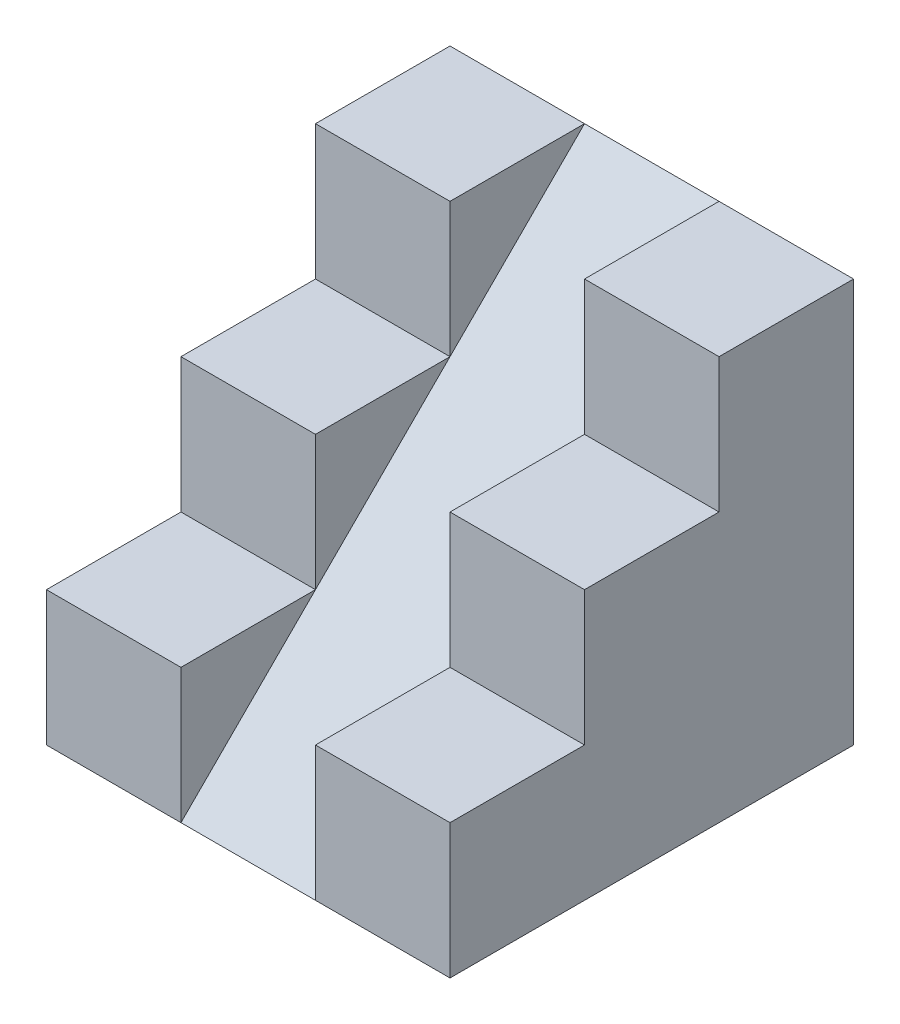
ISO-10303-21;
HEADER;
FILE_DESCRIPTION(('STEP AP214'),'2;1');
FILE_NAME('part.step','',(''),(''),'','','');
FILE_SCHEMA(('AUTOMOTIVE_DESIGN { 1 0 10303 214 1 1 1 1 }'));
ENDSEC;
DATA;
#1=APPLICATION_CONTEXT('core data for automotive mechanical design processes');
#2=APPLICATION_PROTOCOL_DEFINITION('international standard','automotive_design',2000,#1);
#3=PRODUCT_CONTEXT('',#1,'mechanical');
#4=PRODUCT('Part','Part','',(#3));
#5=PRODUCT_RELATED_PRODUCT_CATEGORY('part','',(#4));
#6=PRODUCT_DEFINITION_FORMATION('','',#4);
#7=PRODUCT_DEFINITION_CONTEXT('part definition',#1,'design');
#8=PRODUCT_DEFINITION('design','',#6,#7);
#9=PRODUCT_DEFINITION_SHAPE('','',#8);
#10=(LENGTH_UNIT() NAMED_UNIT(*) SI_UNIT(.MILLI.,.METRE.));
#11=(NAMED_UNIT(*) PLANE_ANGLE_UNIT() SI_UNIT($,.RADIAN.));
#12=(NAMED_UNIT(*) SI_UNIT($,.STERADIAN.) SOLID_ANGLE_UNIT());
#13=UNCERTAINTY_MEASURE_WITH_UNIT(LENGTH_MEASURE(1.E-05),#10,'distance_accuracy_value','');
#14=(GEOMETRIC_REPRESENTATION_CONTEXT(3) GLOBAL_UNCERTAINTY_ASSIGNED_CONTEXT((#13)) GLOBAL_UNIT_ASSIGNED_CONTEXT((#10,
#11,#12)) REPRESENTATION_CONTEXT('',''));
#15=CARTESIAN_POINT('',(0.,0.,0.));
#16=DIRECTION('',(0.,0.,1.));
#17=DIRECTION('',(1.,0.,0.));
#18=AXIS2_PLACEMENT_3D('',#15,#16,#17);
#19=CARTESIAN_POINT('',(30.,60.,20.));
#20=DIRECTION('',(0.,-1.,0.));
#21=DIRECTION('',(0.,0.,-1.));
#22=AXIS2_PLACEMENT_3D('',#19,#20,#21);
#23=PLANE('',#22);
#24=DIRECTION('',(0.,0.,1.));
#25=VECTOR('',#24,1.);
#26=CARTESIAN_POINT('',(-10.,60.,0.));
#27=LINE('',#26,#25);
#28=CARTESIAN_POINT('',(-10.,60.,0.));
#29=VERTEX_POINT('',#28);
#30=CARTESIAN_POINT('',(-10.,60.,20.));
#31=VERTEX_POINT('',#30);
#32=EDGE_CURVE('E270',#29,#31,#27,.T.);
#33=ORIENTED_EDGE('',*,*,#32,.F.);
#34=DIRECTION('',(-1.,0.,0.));
#35=VECTOR('',#34,1.);
#36=CARTESIAN_POINT('',(30.,60.,0.));
#37=LINE('',#36,#35);
#38=CARTESIAN_POINT('',(-30.,60.,0.));
#39=VERTEX_POINT('',#38);
#40=EDGE_CURVE('E43',#29,#39,#37,.T.);
#41=ORIENTED_EDGE('',*,*,#40,.T.);
#42=DIRECTION('',(0.,0.,1.));
#43=VECTOR('',#42,1.);
#44=CARTESIAN_POINT('',(-30.,60.,20.));
#45=LINE('',#44,#43);
#46=CARTESIAN_POINT('',(-30.,60.,20.));
#47=VERTEX_POINT('',#46);
#48=EDGE_CURVE('E144',#39,#47,#45,.T.);
#49=ORIENTED_EDGE('',*,*,#48,.T.);
#50=DIRECTION('',(-1.,0.,0.));
#51=VECTOR('',#50,1.);
#52=CARTESIAN_POINT('',(30.,60.,20.));
#53=LINE('',#52,#51);
#54=EDGE_CURVE('E175',#31,#47,#53,.T.);
#55=ORIENTED_EDGE('',*,*,#54,.F.);
#56=EDGE_LOOP('',(#33,#41,#49,#55));
#57=FACE_BOUND('',#56,.T.);
#58=ADVANCED_FACE('F34',(#57),#23,.F.);
#59=CARTESIAN_POINT('',(30.,40.,20.));
#60=DIRECTION('',(0.,0.,-1.));
#61=DIRECTION('',(0.,1.,0.));
#62=AXIS2_PLACEMENT_3D('',#59,#60,#61);
#63=PLANE('',#62);
#64=DIRECTION('',(0.,-1.,0.));
#65=VECTOR('',#64,1.);
#66=CARTESIAN_POINT('',(-10.,0.,20.));
#67=LINE('',#66,#65);
#68=CARTESIAN_POINT('',(-10.,40.,20.));
#69=VERTEX_POINT('',#68);
#70=EDGE_CURVE('E191',#31,#69,#67,.T.);
#71=ORIENTED_EDGE('',*,*,#70,.F.);
#72=ORIENTED_EDGE('',*,*,#54,.T.);
#73=DIRECTION('',(0.,-1.,0.));
#74=VECTOR('',#73,1.);
#75=CARTESIAN_POINT('',(-30.,40.,20.));
#76=LINE('',#75,#74);
#77=CARTESIAN_POINT('',(-30.,40.,20.));
#78=VERTEX_POINT('',#77);
#79=EDGE_CURVE('E148',#47,#78,#76,.T.);
#80=ORIENTED_EDGE('',*,*,#79,.T.);
#81=DIRECTION('',(-1.,0.,0.));
#82=VECTOR('',#81,1.);
#83=CARTESIAN_POINT('',(30.,40.,20.));
#84=LINE('',#83,#82);
#85=EDGE_CURVE('E172',#69,#78,#84,.T.);
#86=ORIENTED_EDGE('',*,*,#85,.F.);
#87=EDGE_LOOP('',(#71,#72,#80,#86));
#88=FACE_BOUND('',#87,.T.);
#89=ADVANCED_FACE('F185',(#88),#63,.F.);
#90=CARTESIAN_POINT('',(30.,20.,60.));
#91=DIRECTION('',(0.,-1.,0.));
#92=DIRECTION('',(0.,0.,-1.));
#93=AXIS2_PLACEMENT_3D('',#90,#91,#92);
#94=PLANE('',#93);
#95=DIRECTION('',(0.,0.,1.));
#96=VECTOR('',#95,1.);
#97=CARTESIAN_POINT('',(-10.,20.,0.));
#98=LINE('',#97,#96);
#99=CARTESIAN_POINT('',(-10.,20.,40.));
#100=VERTEX_POINT('',#99);
#101=CARTESIAN_POINT('',(-10.,20.,60.));
#102=VERTEX_POINT('',#101);
#103=EDGE_CURVE('E229',#100,#102,#98,.T.);
#104=ORIENTED_EDGE('',*,*,#103,.F.);
#105=DIRECTION('',(-1.,0.,0.));
#106=VECTOR('',#105,1.);
#107=CARTESIAN_POINT('',(30.,20.,40.));
#108=LINE('',#107,#106);
#109=CARTESIAN_POINT('',(-30.,20.,40.));
#110=VERTEX_POINT('',#109);
#111=EDGE_CURVE('E130',#100,#110,#108,.T.);
#112=ORIENTED_EDGE('',*,*,#111,.T.);
#113=DIRECTION('',(0.,0.,1.));
#114=VECTOR('',#113,1.);
#115=CARTESIAN_POINT('',(-30.,20.,60.));
#116=LINE('',#115,#114);
#117=CARTESIAN_POINT('',(-30.,20.,60.));
#118=VERTEX_POINT('',#117);
#119=EDGE_CURVE('E157',#110,#118,#116,.T.);
#120=ORIENTED_EDGE('',*,*,#119,.T.);
#121=DIRECTION('',(-1.,0.,0.));
#122=VECTOR('',#121,1.);
#123=CARTESIAN_POINT('',(30.,20.,60.));
#124=LINE('',#123,#122);
#125=EDGE_CURVE('E131',#102,#118,#124,.T.);
#126=ORIENTED_EDGE('',*,*,#125,.F.);
#127=EDGE_LOOP('',(#104,#112,#120,#126));
#128=FACE_BOUND('',#127,.T.);
#129=ADVANCED_FACE('F321',(#128),#94,.F.);
#130=CARTESIAN_POINT('',(30.,0.,60.));
#131=DIRECTION('',(0.,0.,-1.));
#132=DIRECTION('',(-1.,0.,0.));
#133=AXIS2_PLACEMENT_3D('',#130,#131,#132);
#134=PLANE('',#133);
#135=DIRECTION('',(0.,-1.,0.));
#136=VECTOR('',#135,1.);
#137=CARTESIAN_POINT('',(-10.,0.,60.));
#138=LINE('',#137,#136);
#139=CARTESIAN_POINT('',(-10.,0.,60.));
#140=VERTEX_POINT('',#139);
#141=EDGE_CURVE('E306',#102,#140,#138,.T.);
#142=ORIENTED_EDGE('',*,*,#141,.F.);
#143=ORIENTED_EDGE('',*,*,#125,.T.);
#144=DIRECTION('',(0.,-1.,0.));
#145=VECTOR('',#144,1.);
#146=CARTESIAN_POINT('',(-30.,0.,60.));
#147=LINE('',#146,#145);
#148=CARTESIAN_POINT('',(-30.,0.,60.));
#149=VERTEX_POINT('',#148);
#150=EDGE_CURVE('E160',#118,#149,#147,.T.);
#151=ORIENTED_EDGE('',*,*,#150,.T.);
#152=DIRECTION('',(-1.,0.,0.));
#153=VECTOR('',#152,1.);
#154=CARTESIAN_POINT('',(30.,0.,60.));
#155=LINE('',#154,#153);
#156=EDGE_CURVE('E81',#140,#149,#155,.T.);
#157=ORIENTED_EDGE('',*,*,#156,.F.);
#158=EDGE_LOOP('',(#142,#143,#151,#157));
#159=FACE_BOUND('',#158,.T.);
#160=ADVANCED_FACE('F318',(#159),#134,.F.);
#161=CARTESIAN_POINT('',(30.,40.,40.));
#162=DIRECTION('',(0.,-1.,0.));
#163=DIRECTION('',(0.,0.,-1.));
#164=AXIS2_PLACEMENT_3D('',#161,#162,#163);
#165=PLANE('',#164);
#166=DIRECTION('',(0.,0.,1.));
#167=VECTOR('',#166,1.);
#168=CARTESIAN_POINT('',(-10.,40.,0.));
#169=LINE('',#168,#167);
#170=CARTESIAN_POINT('',(-10.,40.,40.));
#171=VERTEX_POINT('',#170);
#172=EDGE_CURVE('E145',#69,#171,#169,.T.);
#173=ORIENTED_EDGE('',*,*,#172,.F.);
#174=ORIENTED_EDGE('',*,*,#85,.T.);
#175=DIRECTION('',(0.,0.,1.));
#176=VECTOR('',#175,1.);
#177=CARTESIAN_POINT('',(-30.,40.,40.));
#178=LINE('',#177,#176);
#179=CARTESIAN_POINT('',(-30.,40.,40.));
#180=VERTEX_POINT('',#179);
#181=EDGE_CURVE('E151',#78,#180,#178,.T.);
#182=ORIENTED_EDGE('',*,*,#181,.T.);
#183=DIRECTION('',(-1.,0.,0.));
#184=VECTOR('',#183,1.);
#185=CARTESIAN_POINT('',(30.,40.,40.));
#186=LINE('',#185,#184);
#187=EDGE_CURVE('E168',#171,#180,#186,.T.);
#188=ORIENTED_EDGE('',*,*,#187,.F.);
#189=EDGE_LOOP('',(#173,#174,#182,#188));
#190=FACE_BOUND('',#189,.T.);
#191=ADVANCED_FACE('F204',(#190),#165,.F.);
#192=CARTESIAN_POINT('',(30.,20.,40.));
#193=DIRECTION('',(0.,0.,-1.));
#194=DIRECTION('',(-1.,0.,0.));
#195=AXIS2_PLACEMENT_3D('',#192,#193,#194);
#196=PLANE('',#195);
#197=DIRECTION('',(0.,-1.,0.));
#198=VECTOR('',#197,1.);
#199=CARTESIAN_POINT('',(-10.,0.,40.));
#200=LINE('',#199,#198);
#201=EDGE_CURVE('E271',#171,#100,#200,.T.);
#202=ORIENTED_EDGE('',*,*,#201,.F.);
#203=ORIENTED_EDGE('',*,*,#187,.T.);
#204=DIRECTION('',(0.,-1.,0.));
#205=VECTOR('',#204,1.);
#206=CARTESIAN_POINT('',(-30.,20.,40.));
#207=LINE('',#206,#205);
#208=EDGE_CURVE('E154',#180,#110,#207,.T.);
#209=ORIENTED_EDGE('',*,*,#208,.T.);
#210=ORIENTED_EDGE('',*,*,#111,.F.);
#211=EDGE_LOOP('',(#202,#203,#209,#210));
#212=FACE_BOUND('',#211,.T.);
#213=ADVANCED_FACE('F325',(#212),#196,.F.);
#214=CARTESIAN_POINT('',(30.,60.,0.));
#215=DIRECTION('',(0.,0.,1.));
#216=DIRECTION('',(0.,-1.,0.));
#217=AXIS2_PLACEMENT_3D('',#214,#215,#216);
#218=PLANE('',#217);
#219=DIRECTION('',(0.,1.,0.));
#220=VECTOR('',#219,1.);
#221=CARTESIAN_POINT('',(-30.,60.,0.));
#222=LINE('',#221,#220);
#223=CARTESIAN_POINT('',(-30.,0.,0.));
#224=VERTEX_POINT('',#223);
#225=EDGE_CURVE('E141',#224,#39,#222,.T.);
#226=ORIENTED_EDGE('',*,*,#225,.T.);
#227=ORIENTED_EDGE('',*,*,#40,.F.);
#228=DIRECTION('',(1.,0.,0.));
#229=VECTOR('',#228,1.);
#230=CARTESIAN_POINT('',(-10.,60.,0.));
#231=LINE('',#230,#229);
#232=CARTESIAN_POINT('',(10.,60.,0.));
#233=VERTEX_POINT('',#232);
#234=EDGE_CURVE('E267',#29,#233,#231,.T.);
#235=ORIENTED_EDGE('',*,*,#234,.T.);
#236=CARTESIAN_POINT('',(30.,60.,0.));
#237=VERTEX_POINT('',#236);
#238=EDGE_CURVE('E12',#237,#233,#37,.T.);
#239=ORIENTED_EDGE('',*,*,#238,.F.);
#240=DIRECTION('',(0.,1.,0.));
#241=VECTOR('',#240,1.);
#242=CARTESIAN_POINT('',(30.,60.,0.));
#243=LINE('',#242,#241);
#244=CARTESIAN_POINT('',(30.,0.,0.));
#245=VERTEX_POINT('',#244);
#246=EDGE_CURVE('E163',#245,#237,#243,.T.);
#247=ORIENTED_EDGE('',*,*,#246,.F.);
#248=DIRECTION('',(-1.,0.,0.));
#249=VECTOR('',#248,1.);
#250=CARTESIAN_POINT('',(30.,0.,0.));
#251=LINE('',#250,#249);
#252=EDGE_CURVE('E137',#245,#224,#251,.T.);
#253=ORIENTED_EDGE('',*,*,#252,.T.);
#254=EDGE_LOOP('',(#226,#227,#235,#239,#247,#253));
#255=FACE_BOUND('',#254,.T.);
#256=ADVANCED_FACE('F36',(#255),#218,.F.);
#257=ORIENTED_EDGE('',*,*,#238,.T.);
#258=DIRECTION('',(0.,0.,1.));
#259=VECTOR('',#258,1.);
#260=CARTESIAN_POINT('',(10.,60.,0.));
#261=LINE('',#260,#259);
#262=CARTESIAN_POINT('',(10.,60.,20.));
#263=VERTEX_POINT('',#262);
#264=EDGE_CURVE('E256',#233,#263,#261,.T.);
#265=ORIENTED_EDGE('',*,*,#264,.T.);
#266=CARTESIAN_POINT('',(30.,60.,20.));
#267=VERTEX_POINT('',#266);
#268=EDGE_CURVE('E176',#267,#263,#53,.T.);
#269=ORIENTED_EDGE('',*,*,#268,.F.);
#270=DIRECTION('',(0.,0.,1.));
#271=VECTOR('',#270,1.);
#272=CARTESIAN_POINT('',(30.,60.,20.));
#273=LINE('',#272,#271);
#274=EDGE_CURVE('E93',#237,#267,#273,.T.);
#275=ORIENTED_EDGE('',*,*,#274,.F.);
#276=EDGE_LOOP('',(#257,#265,#269,#275));
#277=FACE_BOUND('',#276,.T.);
#278=ADVANCED_FACE('F260',(#277),#23,.F.);
#279=ORIENTED_EDGE('',*,*,#268,.T.);
#280=DIRECTION('',(0.,-1.,0.));
#281=VECTOR('',#280,1.);
#282=CARTESIAN_POINT('',(10.,0.,20.));
#283=LINE('',#282,#281);
#284=CARTESIAN_POINT('',(10.,40.,20.));
#285=VERTEX_POINT('',#284);
#286=EDGE_CURVE('E253',#263,#285,#283,.T.);
#287=ORIENTED_EDGE('',*,*,#286,.T.);
#288=CARTESIAN_POINT('',(30.,40.,20.));
#289=VERTEX_POINT('',#288);
#290=EDGE_CURVE('E173',#289,#285,#84,.T.);
#291=ORIENTED_EDGE('',*,*,#290,.F.);
#292=DIRECTION('',(0.,-1.,0.));
#293=VECTOR('',#292,1.);
#294=CARTESIAN_POINT('',(30.,40.,20.));
#295=LINE('',#294,#293);
#296=EDGE_CURVE('E289',#267,#289,#295,.T.);
#297=ORIENTED_EDGE('',*,*,#296,.F.);
#298=EDGE_LOOP('',(#279,#287,#291,#297));
#299=FACE_BOUND('',#298,.T.);
#300=ADVANCED_FACE('F347',(#299),#63,.F.);
#301=ORIENTED_EDGE('',*,*,#290,.T.);
#302=DIRECTION('',(0.,0.,1.));
#303=VECTOR('',#302,1.);
#304=CARTESIAN_POINT('',(10.,40.,0.));
#305=LINE('',#304,#303);
#306=CARTESIAN_POINT('',(10.,40.,40.));
#307=VERTEX_POINT('',#306);
#308=EDGE_CURVE('E275',#285,#307,#305,.T.);
#309=ORIENTED_EDGE('',*,*,#308,.T.);
#310=CARTESIAN_POINT('',(30.,40.,40.));
#311=VERTEX_POINT('',#310);
#312=EDGE_CURVE('E169',#311,#307,#186,.T.);
#313=ORIENTED_EDGE('',*,*,#312,.F.);
#314=DIRECTION('',(0.,0.,1.));
#315=VECTOR('',#314,1.);
#316=CARTESIAN_POINT('',(30.,40.,40.));
#317=LINE('',#316,#315);
#318=EDGE_CURVE('E291',#289,#311,#317,.T.);
#319=ORIENTED_EDGE('',*,*,#318,.F.);
#320=EDGE_LOOP('',(#301,#309,#313,#319));
#321=FACE_BOUND('',#320,.T.);
#322=ADVANCED_FACE('F295',(#321),#165,.F.);
#323=ORIENTED_EDGE('',*,*,#312,.T.);
#324=DIRECTION('',(0.,-1.,0.));
#325=VECTOR('',#324,1.);
#326=CARTESIAN_POINT('',(10.,0.,40.));
#327=LINE('',#326,#325);
#328=CARTESIAN_POINT('',(10.,20.,40.));
#329=VERTEX_POINT('',#328);
#330=EDGE_CURVE('E279',#307,#329,#327,.T.);
#331=ORIENTED_EDGE('',*,*,#330,.T.);
#332=CARTESIAN_POINT('',(30.,20.,40.));
#333=VERTEX_POINT('',#332);
#334=EDGE_CURVE('E166',#333,#329,#108,.T.);
#335=ORIENTED_EDGE('',*,*,#334,.F.);
#336=DIRECTION('',(0.,-1.,0.));
#337=VECTOR('',#336,1.);
#338=CARTESIAN_POINT('',(30.,20.,40.));
#339=LINE('',#338,#337);
#340=EDGE_CURVE('E116',#311,#333,#339,.T.);
#341=ORIENTED_EDGE('',*,*,#340,.F.);
#342=EDGE_LOOP('',(#323,#331,#335,#341));
#343=FACE_BOUND('',#342,.T.);
#344=ADVANCED_FACE('F298',(#343),#196,.F.);
#345=ORIENTED_EDGE('',*,*,#334,.T.);
#346=DIRECTION('',(0.,0.,1.));
#347=VECTOR('',#346,1.);
#348=CARTESIAN_POINT('',(10.,20.,0.));
#349=LINE('',#348,#347);
#350=CARTESIAN_POINT('',(10.,20.,60.));
#351=VERTEX_POINT('',#350);
#352=EDGE_CURVE('E127',#329,#351,#349,.T.);
#353=ORIENTED_EDGE('',*,*,#352,.T.);
#354=CARTESIAN_POINT('',(30.,20.,60.));
#355=VERTEX_POINT('',#354);
#356=EDGE_CURVE('E123',#355,#351,#124,.T.);
#357=ORIENTED_EDGE('',*,*,#356,.F.);
#358=DIRECTION('',(0.,0.,1.));
#359=VECTOR('',#358,1.);
#360=CARTESIAN_POINT('',(30.,20.,60.));
#361=LINE('',#360,#359);
#362=EDGE_CURVE('E109',#333,#355,#361,.T.);
#363=ORIENTED_EDGE('',*,*,#362,.F.);
#364=EDGE_LOOP('',(#345,#353,#357,#363));
#365=FACE_BOUND('',#364,.T.);
#366=ADVANCED_FACE('F124',(#365),#94,.F.);
#367=ORIENTED_EDGE('',*,*,#356,.T.);
#368=DIRECTION('',(0.,-1.,0.));
#369=VECTOR('',#368,1.);
#370=CARTESIAN_POINT('',(10.,0.,60.));
#371=LINE('',#370,#369);
#372=CARTESIAN_POINT('',(10.,0.,60.));
#373=VERTEX_POINT('',#372);
#374=EDGE_CURVE('E269',#351,#373,#371,.T.);
#375=ORIENTED_EDGE('',*,*,#374,.T.);
#376=CARTESIAN_POINT('',(30.,0.,60.));
#377=VERTEX_POINT('',#376);
#378=EDGE_CURVE('E135',#377,#373,#155,.T.);
#379=ORIENTED_EDGE('',*,*,#378,.F.);
#380=DIRECTION('',(0.,-1.,0.));
#381=VECTOR('',#380,1.);
#382=CARTESIAN_POINT('',(30.,0.,60.));
#383=LINE('',#382,#381);
#384=EDGE_CURVE('E113',#355,#377,#383,.T.);
#385=ORIENTED_EDGE('',*,*,#384,.F.);
#386=EDGE_LOOP('',(#367,#375,#379,#385));
#387=FACE_BOUND('',#386,.T.);
#388=ADVANCED_FACE('F133',(#387),#134,.F.);
#389=CARTESIAN_POINT('',(30.,0.,0.));
#390=DIRECTION('',(0.,1.,0.));
#391=DIRECTION('',(0.,0.,1.));
#392=AXIS2_PLACEMENT_3D('',#389,#390,#391);
#393=PLANE('',#392);
#394=DIRECTION('',(0.,0.,-1.));
#395=VECTOR('',#394,1.);
#396=CARTESIAN_POINT('',(-30.,0.,0.));
#397=LINE('',#396,#395);
#398=EDGE_CURVE('E85',#149,#224,#397,.T.);
#399=ORIENTED_EDGE('',*,*,#398,.T.);
#400=ORIENTED_EDGE('',*,*,#252,.F.);
#401=DIRECTION('',(0.,0.,-1.));
#402=VECTOR('',#401,1.);
#403=CARTESIAN_POINT('',(30.,0.,0.));
#404=LINE('',#403,#402);
#405=EDGE_CURVE('E51',#377,#245,#404,.T.);
#406=ORIENTED_EDGE('',*,*,#405,.F.);
#407=ORIENTED_EDGE('',*,*,#378,.T.);
#408=DIRECTION('',(1.,0.,0.));
#409=VECTOR('',#408,1.);
#410=CARTESIAN_POINT('',(-10.,0.,60.));
#411=LINE('',#410,#409);
#412=EDGE_CURVE('E283',#140,#373,#411,.T.);
#413=ORIENTED_EDGE('',*,*,#412,.F.);
#414=ORIENTED_EDGE('',*,*,#156,.T.);
#415=EDGE_LOOP('',(#399,#400,#406,#407,#413,#414));
#416=FACE_BOUND('',#415,.T.);
#417=ADVANCED_FACE('F434',(#416),#393,.F.);
#418=CARTESIAN_POINT('',(30.,0.,0.));
#419=DIRECTION('',(-1.,0.,0.));
#420=DIRECTION('',(0.,0.,1.));
#421=AXIS2_PLACEMENT_3D('',#418,#419,#420);
#422=PLANE('',#421);
#423=ORIENTED_EDGE('',*,*,#246,.T.);
#424=ORIENTED_EDGE('',*,*,#274,.T.);
#425=ORIENTED_EDGE('',*,*,#296,.T.);
#426=ORIENTED_EDGE('',*,*,#318,.T.);
#427=ORIENTED_EDGE('',*,*,#340,.T.);
#428=ORIENTED_EDGE('',*,*,#362,.T.);
#429=ORIENTED_EDGE('',*,*,#384,.T.);
#430=ORIENTED_EDGE('',*,*,#405,.T.);
#431=EDGE_LOOP('',(#423,#424,#425,#426,#427,#428,#429,#430));
#432=FACE_BOUND('',#431,.T.);
#433=ADVANCED_FACE('F111',(#432),#422,.F.);
#434=CARTESIAN_POINT('',(-30.,0.,0.));
#435=DIRECTION('',(-1.,0.,0.));
#436=DIRECTION('',(0.,0.,1.));
#437=AXIS2_PLACEMENT_3D('',#434,#435,#436);
#438=PLANE('',#437);
#439=ORIENTED_EDGE('',*,*,#225,.F.);
#440=ORIENTED_EDGE('',*,*,#398,.F.);
#441=ORIENTED_EDGE('',*,*,#150,.F.);
#442=ORIENTED_EDGE('',*,*,#119,.F.);
#443=ORIENTED_EDGE('',*,*,#208,.F.);
#444=ORIENTED_EDGE('',*,*,#181,.F.);
#445=ORIENTED_EDGE('',*,*,#79,.F.);
#446=ORIENTED_EDGE('',*,*,#48,.F.);
#447=EDGE_LOOP('',(#439,#440,#441,#442,#443,#444,#445,#446));
#448=FACE_BOUND('',#447,.T.);
#449=ADVANCED_FACE('F198',(#448),#438,.T.);
#450=CARTESIAN_POINT('',(-10.,30.,30.));
#451=DIRECTION('',(0.,-0.707106781186548,-0.707106781186548));
#452=DIRECTION('',(0.,0.707106781186548,-0.707106781186548));
#453=AXIS2_PLACEMENT_3D('',#450,#451,#452);
#454=PLANE('',#453);
#455=DIRECTION('',(0.,0.707106781186548,-0.707106781186548));
#456=VECTOR('',#455,1.);
#457=CARTESIAN_POINT('',(10.,30.,30.));
#458=LINE('',#457,#456);
#459=EDGE_CURVE('E282',#329,#285,#458,.T.);
#460=ORIENTED_EDGE('',*,*,#459,.T.);
#461=DIRECTION('',(0.,0.707106781186548,-0.707106781186548));
#462=VECTOR('',#461,1.);
#463=CARTESIAN_POINT('',(10.,30.,30.));
#464=LINE('',#463,#462);
#465=EDGE_CURVE('E249',#285,#233,#464,.T.);
#466=ORIENTED_EDGE('',*,*,#465,.T.);
#467=ORIENTED_EDGE('',*,*,#234,.F.);
#468=DIRECTION('',(0.,0.707106781186548,-0.707106781186548));
#469=VECTOR('',#468,1.);
#470=CARTESIAN_POINT('',(-10.,30.,30.));
#471=LINE('',#470,#469);
#472=EDGE_CURVE('E263',#69,#29,#471,.T.);
#473=ORIENTED_EDGE('',*,*,#472,.F.);
#474=DIRECTION('',(0.,0.707106781186548,-0.707106781186548));
#475=VECTOR('',#474,1.);
#476=CARTESIAN_POINT('',(-10.,30.,30.));
#477=LINE('',#476,#475);
#478=EDGE_CURVE('E274',#100,#69,#477,.T.);
#479=ORIENTED_EDGE('',*,*,#478,.F.);
#480=DIRECTION('',(0.,0.707106781186548,-0.707106781186548));
#481=VECTOR('',#480,1.);
#482=CARTESIAN_POINT('',(-10.,30.,30.));
#483=LINE('',#482,#481);
#484=EDGE_CURVE('E329',#140,#100,#483,.T.);
#485=ORIENTED_EDGE('',*,*,#484,.F.);
#486=ORIENTED_EDGE('',*,*,#412,.T.);
#487=DIRECTION('',(0.,0.707106781186548,-0.707106781186548));
#488=VECTOR('',#487,1.);
#489=CARTESIAN_POINT('',(10.,30.,30.));
#490=LINE('',#489,#488);
#491=EDGE_CURVE('E303',#373,#329,#490,.T.);
#492=ORIENTED_EDGE('',*,*,#491,.T.);
#493=EDGE_LOOP('',(#460,#466,#467,#473,#479,#485,#486,#492));
#494=FACE_BOUND('',#493,.T.);
#495=ADVANCED_FACE('F302',(#494),#454,.F.);
#496=CARTESIAN_POINT('',(-10.,0.,0.));
#497=DIRECTION('',(1.,0.,0.));
#498=DIRECTION('',(0.,0.,-1.));
#499=AXIS2_PLACEMENT_3D('',#496,#497,#498);
#500=PLANE('',#499);
#501=ORIENTED_EDGE('',*,*,#201,.T.);
#502=ORIENTED_EDGE('',*,*,#478,.T.);
#503=ORIENTED_EDGE('',*,*,#172,.T.);
#504=EDGE_LOOP('',(#501,#502,#503));
#505=FACE_BOUND('',#504,.T.);
#506=ADVANCED_FACE('F328',(#505),#500,.T.);
#507=CARTESIAN_POINT('',(10.,0.,0.));
#508=DIRECTION('',(1.,0.,0.));
#509=DIRECTION('',(0.,0.,-1.));
#510=AXIS2_PLACEMENT_3D('',#507,#508,#509);
#511=PLANE('',#510);
#512=ORIENTED_EDGE('',*,*,#330,.F.);
#513=ORIENTED_EDGE('',*,*,#308,.F.);
#514=ORIENTED_EDGE('',*,*,#459,.F.);
#515=EDGE_LOOP('',(#512,#513,#514));
#516=FACE_BOUND('',#515,.T.);
#517=ADVANCED_FACE('F301',(#516),#511,.F.);
#518=CARTESIAN_POINT('',(-10.,0.,0.));
#519=DIRECTION('',(1.,0.,0.));
#520=DIRECTION('',(0.,0.,-1.));
#521=AXIS2_PLACEMENT_3D('',#518,#519,#520);
#522=PLANE('',#521);
#523=ORIENTED_EDGE('',*,*,#70,.T.);
#524=ORIENTED_EDGE('',*,*,#472,.T.);
#525=ORIENTED_EDGE('',*,*,#32,.T.);
#526=EDGE_LOOP('',(#523,#524,#525));
#527=FACE_BOUND('',#526,.T.);
#528=ADVANCED_FACE('F313',(#527),#522,.T.);
#529=CARTESIAN_POINT('',(10.,0.,0.));
#530=DIRECTION('',(1.,0.,0.));
#531=DIRECTION('',(0.,0.,-1.));
#532=AXIS2_PLACEMENT_3D('',#529,#530,#531);
#533=PLANE('',#532);
#534=ORIENTED_EDGE('',*,*,#286,.F.);
#535=ORIENTED_EDGE('',*,*,#264,.F.);
#536=ORIENTED_EDGE('',*,*,#465,.F.);
#537=EDGE_LOOP('',(#534,#535,#536));
#538=FACE_BOUND('',#537,.T.);
#539=ADVANCED_FACE('F255',(#538),#533,.F.);
#540=CARTESIAN_POINT('',(-10.,0.,0.));
#541=DIRECTION('',(1.,0.,0.));
#542=DIRECTION('',(0.,0.,-1.));
#543=AXIS2_PLACEMENT_3D('',#540,#541,#542);
#544=PLANE('',#543);
#545=ORIENTED_EDGE('',*,*,#141,.T.);
#546=ORIENTED_EDGE('',*,*,#484,.T.);
#547=ORIENTED_EDGE('',*,*,#103,.T.);
#548=EDGE_LOOP('',(#545,#546,#547));
#549=FACE_BOUND('',#548,.T.);
#550=ADVANCED_FACE('F331',(#549),#544,.T.);
#551=CARTESIAN_POINT('',(10.,0.,0.));
#552=DIRECTION('',(1.,0.,0.));
#553=DIRECTION('',(0.,0.,-1.));
#554=AXIS2_PLACEMENT_3D('',#551,#552,#553);
#555=PLANE('',#554);
#556=ORIENTED_EDGE('',*,*,#374,.F.);
#557=ORIENTED_EDGE('',*,*,#352,.F.);
#558=ORIENTED_EDGE('',*,*,#491,.F.);
#559=EDGE_LOOP('',(#556,#557,#558));
#560=FACE_BOUND('',#559,.T.);
#561=ADVANCED_FACE('F334',(#560),#555,.F.);
#562=CLOSED_SHELL('',(#58,#89,#129,#160,#191,#213,#256,#278,#300,#322,#344,#366,#388,#417,#433,
#449,#495,#506,#517,#528,#539,#550,#561));
#563=MANIFOLD_SOLID_BREP('B2',#562);
#564=ADVANCED_BREP_SHAPE_REPRESENTATION('',(#18,#563),#14);
#565=SHAPE_DEFINITION_REPRESENTATION(#9,#564);
ENDSEC;
END-ISO-10303-21;
